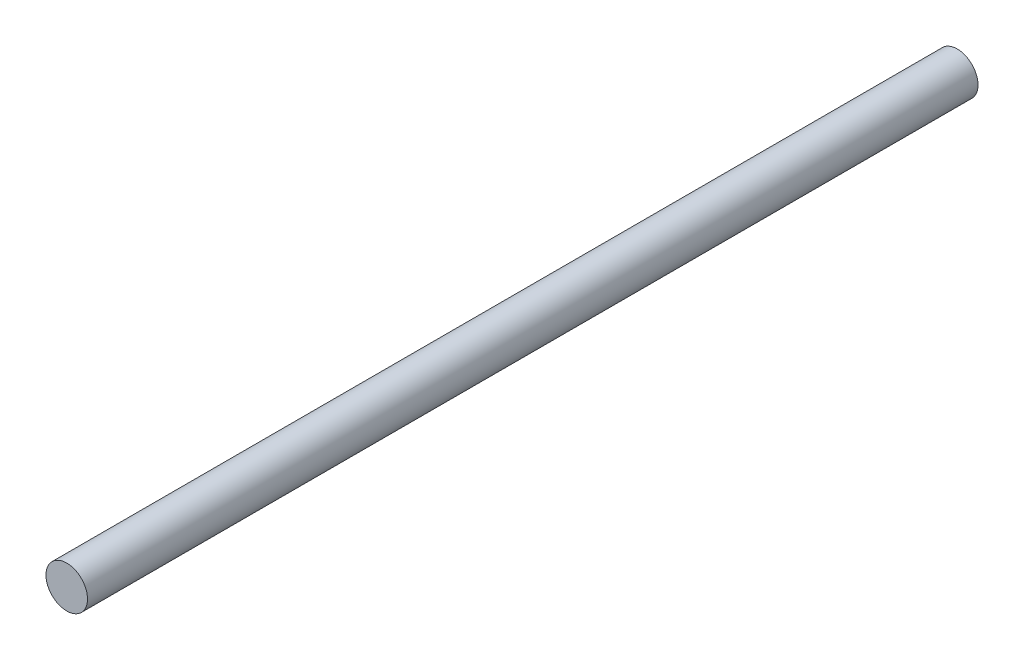
ISO-10303-21;
HEADER;
FILE_DESCRIPTION(('STEP AP214'),'2;1');
FILE_NAME('part.step','',(''),(''),'','','');
FILE_SCHEMA(('AUTOMOTIVE_DESIGN { 1 0 10303 214 1 1 1 1 }'));
ENDSEC;
DATA;
#1=APPLICATION_CONTEXT('core data for automotive mechanical design processes');
#2=APPLICATION_PROTOCOL_DEFINITION('international standard','automotive_design',2000,#1);
#3=PRODUCT_CONTEXT('',#1,'mechanical');
#4=PRODUCT('Part','Part','',(#3));
#5=PRODUCT_RELATED_PRODUCT_CATEGORY('part','',(#4));
#6=PRODUCT_DEFINITION_FORMATION('','',#4);
#7=PRODUCT_DEFINITION_CONTEXT('part definition',#1,'design');
#8=PRODUCT_DEFINITION('design','',#6,#7);
#9=PRODUCT_DEFINITION_SHAPE('','',#8);
#10=(LENGTH_UNIT() NAMED_UNIT(*) SI_UNIT(.MILLI.,.METRE.));
#11=(NAMED_UNIT(*) PLANE_ANGLE_UNIT() SI_UNIT($,.RADIAN.));
#12=(NAMED_UNIT(*) SI_UNIT($,.STERADIAN.) SOLID_ANGLE_UNIT());
#13=UNCERTAINTY_MEASURE_WITH_UNIT(LENGTH_MEASURE(1.E-05),#10,'distance_accuracy_value','');
#14=(GEOMETRIC_REPRESENTATION_CONTEXT(3) GLOBAL_UNCERTAINTY_ASSIGNED_CONTEXT((#13)) GLOBAL_UNIT_ASSIGNED_CONTEXT((#10,
#11,#12)) REPRESENTATION_CONTEXT('',''));
#15=CARTESIAN_POINT('',(0.,0.,0.));
#16=DIRECTION('',(0.,0.,1.));
#17=DIRECTION('',(1.,0.,0.));
#18=AXIS2_PLACEMENT_3D('',#15,#16,#17);
#19=CARTESIAN_POINT('',(0.,0.,9.));
#20=DIRECTION('',(0.,0.,-1.));
#21=DIRECTION('',(-1.,0.,0.));
#22=AXIS2_PLACEMENT_3D('',#19,#20,#21);
#23=CYLINDRICAL_SURFACE('',#22,0.21);
#24=CARTESIAN_POINT('',(0.,0.,9.));
#25=DIRECTION('',(0.,0.,1.));
#26=DIRECTION('',(1.,0.,0.));
#27=AXIS2_PLACEMENT_3D('',#24,#25,#26);
#28=CIRCLE('',#27,0.21);
#29=CARTESIAN_POINT('',(0.21,0.,9.));
#30=VERTEX_POINT('',#29);
#31=EDGE_CURVE('E10',#30,#30,#28,.T.);
#32=ORIENTED_EDGE('',*,*,#31,.F.);
#33=EDGE_LOOP('',(#32));
#34=FACE_BOUND('',#33,.T.);
#35=CARTESIAN_POINT('',(0.,0.,0.));
#36=DIRECTION('',(0.,0.,1.));
#37=DIRECTION('',(1.,0.,0.));
#38=AXIS2_PLACEMENT_3D('',#35,#36,#37);
#39=CIRCLE('',#38,0.21);
#40=CARTESIAN_POINT('',(0.21,0.,0.));
#41=VERTEX_POINT('',#40);
#42=EDGE_CURVE('E34',#41,#41,#39,.T.);
#43=ORIENTED_EDGE('',*,*,#42,.T.);
#44=EDGE_LOOP('',(#43));
#45=FACE_BOUND('',#44,.T.);
#46=ADVANCED_FACE('F31',(#34,#45),#23,.T.);
#47=CARTESIAN_POINT('',(0.,0.,9.));
#48=DIRECTION('',(0.,0.,1.));
#49=DIRECTION('',(1.,0.,0.));
#50=AXIS2_PLACEMENT_3D('',#47,#48,#49);
#51=PLANE('',#50);
#52=ORIENTED_EDGE('',*,*,#31,.T.);
#53=EDGE_LOOP('',(#52));
#54=FACE_BOUND('',#53,.T.);
#55=ADVANCED_FACE('F46',(#54),#51,.T.);
#56=CARTESIAN_POINT('',(0.,0.,0.));
#57=DIRECTION('',(0.,0.,1.));
#58=DIRECTION('',(1.,0.,0.));
#59=AXIS2_PLACEMENT_3D('',#56,#57,#58);
#60=PLANE('',#59);
#61=ORIENTED_EDGE('',*,*,#42,.F.);
#62=EDGE_LOOP('',(#61));
#63=FACE_BOUND('',#62,.T.);
#64=ADVANCED_FACE('F44',(#63),#60,.F.);
#65=CLOSED_SHELL('',(#46,#55,#64));
#66=MANIFOLD_SOLID_BREP('B2',#65);
#67=ADVANCED_BREP_SHAPE_REPRESENTATION('',(#18,#66),#14);
#68=SHAPE_DEFINITION_REPRESENTATION(#9,#67);
ENDSEC;
END-ISO-10303-21;
